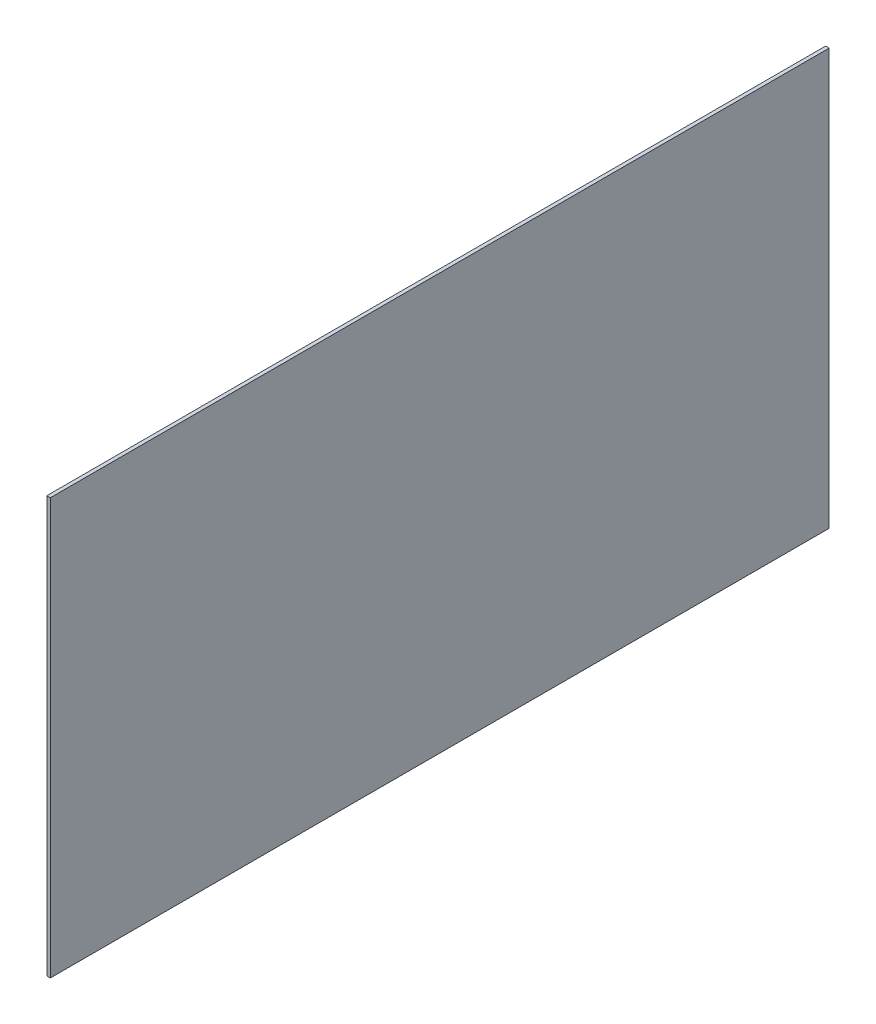
ISO-10303-21;
HEADER;
FILE_DESCRIPTION(('STEP AP214'),'2;1');
FILE_NAME('part.step','',(''),(''),'','','');
FILE_SCHEMA(('AUTOMOTIVE_DESIGN { 1 0 10303 214 1 1 1 1 }'));
ENDSEC;
DATA;
#1=APPLICATION_CONTEXT('core data for automotive mechanical design processes');
#2=APPLICATION_PROTOCOL_DEFINITION('international standard','automotive_design',2000,#1);
#3=PRODUCT_CONTEXT('',#1,'mechanical');
#4=PRODUCT('Part','Part','',(#3));
#5=PRODUCT_RELATED_PRODUCT_CATEGORY('part','',(#4));
#6=PRODUCT_DEFINITION_FORMATION('','',#4);
#7=PRODUCT_DEFINITION_CONTEXT('part definition',#1,'design');
#8=PRODUCT_DEFINITION('design','',#6,#7);
#9=PRODUCT_DEFINITION_SHAPE('','',#8);
#10=(LENGTH_UNIT() NAMED_UNIT(*) SI_UNIT(.MILLI.,.METRE.));
#11=(NAMED_UNIT(*) PLANE_ANGLE_UNIT() SI_UNIT($,.RADIAN.));
#12=(NAMED_UNIT(*) SI_UNIT($,.STERADIAN.) SOLID_ANGLE_UNIT());
#13=UNCERTAINTY_MEASURE_WITH_UNIT(LENGTH_MEASURE(1.E-05),#10,'distance_accuracy_value','');
#14=(GEOMETRIC_REPRESENTATION_CONTEXT(3) GLOBAL_UNCERTAINTY_ASSIGNED_CONTEXT((#13)) GLOBAL_UNIT_ASSIGNED_CONTEXT((#10,
#11,#12)) REPRESENTATION_CONTEXT('',''));
#15=CARTESIAN_POINT('',(0.,0.,0.));
#16=DIRECTION('',(0.,0.,1.));
#17=DIRECTION('',(1.,0.,0.));
#18=AXIS2_PLACEMENT_3D('',#15,#16,#17);
#19=CARTESIAN_POINT('',(-417.425,992.1,165.1));
#20=DIRECTION('',(-1.,0.,0.));
#21=DIRECTION('',(0.,0.,1.));
#22=AXIS2_PLACEMENT_3D('',#19,#20,#21);
#23=PLANE('',#22);
#24=DIRECTION('',(0.,1.,0.));
#25=VECTOR('',#24,1.);
#26=CARTESIAN_POINT('',(-417.425,992.1,-165.1));
#27=LINE('',#26,#25);
#28=CARTESIAN_POINT('',(-417.425,992.1,-165.1));
#29=VERTEX_POINT('',#28);
#30=CARTESIAN_POINT('',(-417.425,1168.4,-165.1));
#31=VERTEX_POINT('',#30);
#32=EDGE_CURVE('E111',#29,#31,#27,.T.);
#33=ORIENTED_EDGE('',*,*,#32,.T.);
#34=DIRECTION('',(0.,0.,-1.));
#35=VECTOR('',#34,1.);
#36=CARTESIAN_POINT('',(-417.425,1168.4,165.1));
#37=LINE('',#36,#35);
#38=CARTESIAN_POINT('',(-417.425,1168.4,165.1));
#39=VERTEX_POINT('',#38);
#40=EDGE_CURVE('E11',#39,#31,#37,.T.);
#41=ORIENTED_EDGE('',*,*,#40,.F.);
#42=DIRECTION('',(0.,1.,0.));
#43=VECTOR('',#42,1.);
#44=CARTESIAN_POINT('',(-417.425,992.1,165.1));
#45=LINE('',#44,#43);
#46=CARTESIAN_POINT('',(-417.425,992.1,165.1));
#47=VERTEX_POINT('',#46);
#48=EDGE_CURVE('E83',#47,#39,#45,.T.);
#49=ORIENTED_EDGE('',*,*,#48,.F.);
#50=DIRECTION('',(0.,0.,-1.));
#51=VECTOR('',#50,1.);
#52=CARTESIAN_POINT('',(-417.425,992.1,165.1));
#53=LINE('',#52,#51);
#54=EDGE_CURVE('E57',#47,#29,#53,.T.);
#55=ORIENTED_EDGE('',*,*,#54,.T.);
#56=EDGE_LOOP('',(#33,#41,#49,#55));
#57=FACE_BOUND('',#56,.T.);
#58=ADVANCED_FACE('F38',(#57),#23,.F.);
#59=CARTESIAN_POINT('',(-418.925,1168.4,165.1));
#60=DIRECTION('',(0.,1.,0.));
#61=DIRECTION('',(0.,0.,1.));
#62=AXIS2_PLACEMENT_3D('',#59,#60,#61);
#63=PLANE('',#62);
#64=DIRECTION('',(1.,0.,0.));
#65=VECTOR('',#64,1.);
#66=CARTESIAN_POINT('',(-418.925,1168.4,-165.1));
#67=LINE('',#66,#65);
#68=CARTESIAN_POINT('',(-418.925,1168.4,-165.1));
#69=VERTEX_POINT('',#68);
#70=EDGE_CURVE('E92',#69,#31,#67,.T.);
#71=ORIENTED_EDGE('',*,*,#70,.F.);
#72=DIRECTION('',(0.,0.,-1.));
#73=VECTOR('',#72,1.);
#74=CARTESIAN_POINT('',(-418.925,1168.4,165.1));
#75=LINE('',#74,#73);
#76=CARTESIAN_POINT('',(-418.925,1168.4,165.1));
#77=VERTEX_POINT('',#76);
#78=EDGE_CURVE('E47',#77,#69,#75,.T.);
#79=ORIENTED_EDGE('',*,*,#78,.F.);
#80=DIRECTION('',(1.,0.,0.));
#81=VECTOR('',#80,1.);
#82=CARTESIAN_POINT('',(-418.925,1168.4,165.1));
#83=LINE('',#82,#81);
#84=EDGE_CURVE('E90',#77,#39,#83,.T.);
#85=ORIENTED_EDGE('',*,*,#84,.T.);
#86=ORIENTED_EDGE('',*,*,#40,.T.);
#87=EDGE_LOOP('',(#71,#79,#85,#86));
#88=FACE_BOUND('',#87,.T.);
#89=ADVANCED_FACE('F89',(#88),#63,.T.);
#90=CARTESIAN_POINT('',(-418.925,992.1,165.1));
#91=DIRECTION('',(-1.,0.,0.));
#92=DIRECTION('',(0.,0.,1.));
#93=AXIS2_PLACEMENT_3D('',#90,#91,#92);
#94=PLANE('',#93);
#95=DIRECTION('',(0.,1.,0.));
#96=VECTOR('',#95,1.);
#97=CARTESIAN_POINT('',(-418.925,992.1,-165.1));
#98=LINE('',#97,#96);
#99=CARTESIAN_POINT('',(-418.925,992.1,-165.1));
#100=VERTEX_POINT('',#99);
#101=EDGE_CURVE('E114',#100,#69,#98,.T.);
#102=ORIENTED_EDGE('',*,*,#101,.F.);
#103=DIRECTION('',(0.,0.,-1.));
#104=VECTOR('',#103,1.);
#105=CARTESIAN_POINT('',(-418.925,992.1,165.1));
#106=LINE('',#105,#104);
#107=CARTESIAN_POINT('',(-418.925,992.1,165.1));
#108=VERTEX_POINT('',#107);
#109=EDGE_CURVE('E70',#108,#100,#106,.T.);
#110=ORIENTED_EDGE('',*,*,#109,.F.);
#111=DIRECTION('',(0.,1.,0.));
#112=VECTOR('',#111,1.);
#113=CARTESIAN_POINT('',(-418.925,992.1,165.1));
#114=LINE('',#113,#112);
#115=EDGE_CURVE('E99',#108,#77,#114,.T.);
#116=ORIENTED_EDGE('',*,*,#115,.T.);
#117=ORIENTED_EDGE('',*,*,#78,.T.);
#118=EDGE_LOOP('',(#102,#110,#116,#117));
#119=FACE_BOUND('',#118,.T.);
#120=ADVANCED_FACE('F102',(#119),#94,.T.);
#121=CARTESIAN_POINT('',(-417.425,992.1,165.1));
#122=DIRECTION('',(0.,-1.,0.));
#123=DIRECTION('',(0.,0.,-1.));
#124=AXIS2_PLACEMENT_3D('',#121,#122,#123);
#125=PLANE('',#124);
#126=DIRECTION('',(-1.,0.,0.));
#127=VECTOR('',#126,1.);
#128=CARTESIAN_POINT('',(-417.425,992.1,-165.1));
#129=LINE('',#128,#127);
#130=EDGE_CURVE('E116',#29,#100,#129,.T.);
#131=ORIENTED_EDGE('',*,*,#130,.F.);
#132=ORIENTED_EDGE('',*,*,#54,.F.);
#133=DIRECTION('',(-1.,0.,0.));
#134=VECTOR('',#133,1.);
#135=CARTESIAN_POINT('',(-417.425,992.1,165.1));
#136=LINE('',#135,#134);
#137=EDGE_CURVE('E104',#47,#108,#136,.T.);
#138=ORIENTED_EDGE('',*,*,#137,.T.);
#139=ORIENTED_EDGE('',*,*,#109,.T.);
#140=EDGE_LOOP('',(#131,#132,#138,#139));
#141=FACE_BOUND('',#140,.T.);
#142=ADVANCED_FACE('F124',(#141),#125,.T.);
#143=CARTESIAN_POINT('',(-417.425,1168.4,165.1));
#144=DIRECTION('',(0.,0.,-1.));
#145=DIRECTION('',(-1.,0.,0.));
#146=AXIS2_PLACEMENT_3D('',#143,#144,#145);
#147=PLANE('',#146);
#148=ORIENTED_EDGE('',*,*,#48,.T.);
#149=ORIENTED_EDGE('',*,*,#84,.F.);
#150=ORIENTED_EDGE('',*,*,#115,.F.);
#151=ORIENTED_EDGE('',*,*,#137,.F.);
#152=EDGE_LOOP('',(#148,#149,#150,#151));
#153=FACE_BOUND('',#152,.T.);
#154=ADVANCED_FACE('F98',(#153),#147,.F.);
#155=CARTESIAN_POINT('',(-417.425,1168.4,-165.1));
#156=DIRECTION('',(0.,0.,-1.));
#157=DIRECTION('',(-1.,0.,0.));
#158=AXIS2_PLACEMENT_3D('',#155,#156,#157);
#159=PLANE('',#158);
#160=ORIENTED_EDGE('',*,*,#32,.F.);
#161=ORIENTED_EDGE('',*,*,#130,.T.);
#162=ORIENTED_EDGE('',*,*,#101,.T.);
#163=ORIENTED_EDGE('',*,*,#70,.T.);
#164=EDGE_LOOP('',(#160,#161,#162,#163));
#165=FACE_BOUND('',#164,.T.);
#166=ADVANCED_FACE('F123',(#165),#159,.T.);
#167=CLOSED_SHELL('',(#58,#89,#120,#142,#154,#166));
#168=MANIFOLD_SOLID_BREP('B2',#167);
#169=ADVANCED_BREP_SHAPE_REPRESENTATION('',(#18,#168),#14);
#170=SHAPE_DEFINITION_REPRESENTATION(#9,#169);
ENDSEC;
END-ISO-10303-21;
